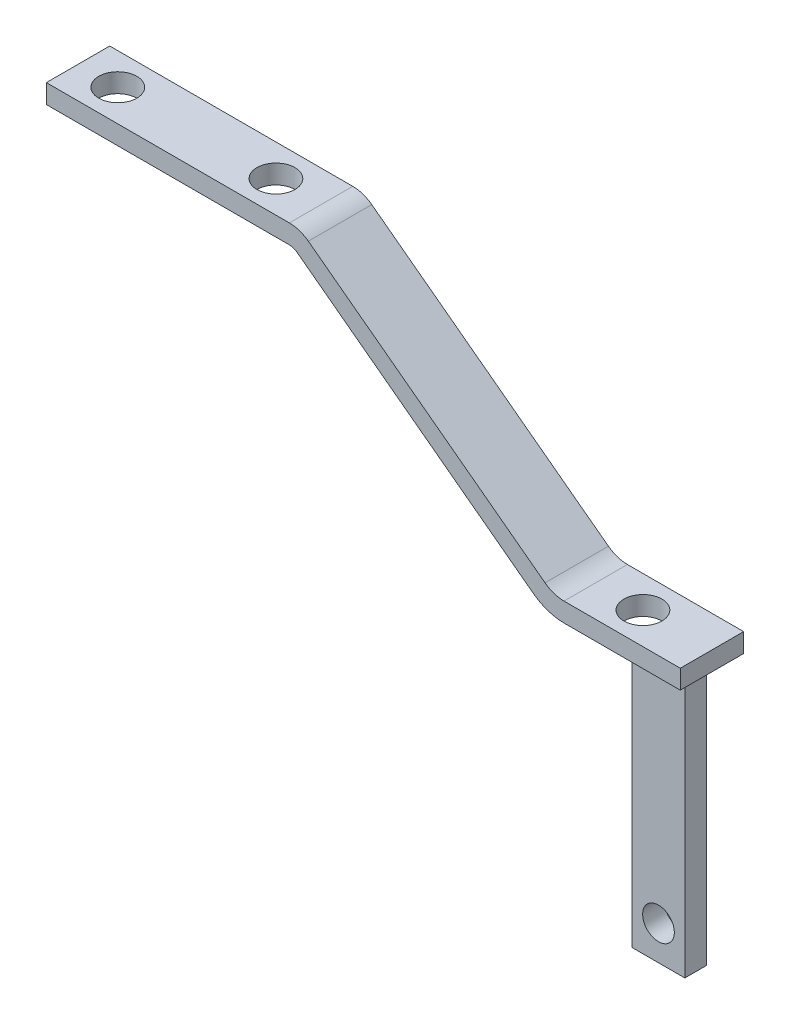
ISO-10303-21;
HEADER;
FILE_DESCRIPTION(('STEP AP214'),'2;1');
FILE_NAME('part.step','',(''),(''),'','','');
FILE_SCHEMA(('AUTOMOTIVE_DESIGN { 1 0 10303 214 1 1 1 1 }'));
ENDSEC;
DATA;
#1=APPLICATION_CONTEXT('core data for automotive mechanical design processes');
#2=APPLICATION_PROTOCOL_DEFINITION('international standard','automotive_design',2000,#1);
#3=PRODUCT_CONTEXT('',#1,'mechanical');
#4=PRODUCT('Part','Part','',(#3));
#5=PRODUCT_RELATED_PRODUCT_CATEGORY('part','',(#4));
#6=PRODUCT_DEFINITION_FORMATION('','',#4);
#7=PRODUCT_DEFINITION_CONTEXT('part definition',#1,'design');
#8=PRODUCT_DEFINITION('design','',#6,#7);
#9=PRODUCT_DEFINITION_SHAPE('','',#8);
#10=(LENGTH_UNIT() NAMED_UNIT(*) SI_UNIT(.MILLI.,.METRE.));
#11=(NAMED_UNIT(*) PLANE_ANGLE_UNIT() SI_UNIT($,.RADIAN.));
#12=(NAMED_UNIT(*) SI_UNIT($,.STERADIAN.) SOLID_ANGLE_UNIT());
#13=UNCERTAINTY_MEASURE_WITH_UNIT(LENGTH_MEASURE(1.E-05),#10,'distance_accuracy_value','');
#14=(GEOMETRIC_REPRESENTATION_CONTEXT(3) GLOBAL_UNCERTAINTY_ASSIGNED_CONTEXT((#13)) GLOBAL_UNIT_ASSIGNED_CONTEXT((#10,
#11,#12)) REPRESENTATION_CONTEXT('',''));
#15=CARTESIAN_POINT('',(0.,0.,0.));
#16=DIRECTION('',(0.,0.,1.));
#17=DIRECTION('',(1.,0.,0.));
#18=AXIS2_PLACEMENT_3D('',#15,#16,#17);
#19=CARTESIAN_POINT('',(81.6666666666667,-33.,10.));
#20=DIRECTION('',(0.,1.,0.));
#21=DIRECTION('',(0.,0.,1.));
#22=AXIS2_PLACEMENT_3D('',#19,#20,#21);
#23=PLANE('',#22);
#24=DIRECTION('',(1.,0.,0.));
#25=VECTOR('',#24,1.);
#26=CARTESIAN_POINT('',(81.6666666666667,-33.,0.));
#27=LINE('',#26,#25);
#28=CARTESIAN_POINT('',(81.6666666666667,-33.,0.));
#29=VERTEX_POINT('',#28);
#30=CARTESIAN_POINT('',(100.,-33.,0.));
#31=VERTEX_POINT('',#30);
#32=EDGE_CURVE('E269',#29,#31,#27,.T.);
#33=ORIENTED_EDGE('',*,*,#32,.T.);
#34=DIRECTION('',(0.,0.,-1.));
#35=VECTOR('',#34,1.);
#36=CARTESIAN_POINT('',(100.,-33.,10.));
#37=LINE('',#36,#35);
#38=CARTESIAN_POINT('',(100.,-33.,10.));
#39=VERTEX_POINT('',#38);
#40=EDGE_CURVE('E312',#39,#31,#37,.T.);
#41=ORIENTED_EDGE('',*,*,#40,.F.);
#42=DIRECTION('',(1.,0.,0.));
#43=VECTOR('',#42,1.);
#44=CARTESIAN_POINT('',(81.6666666666667,-33.,10.));
#45=LINE('',#44,#43);
#46=CARTESIAN_POINT('',(81.6666666666667,-33.,10.));
#47=VERTEX_POINT('',#46);
#48=EDGE_CURVE('E231',#47,#39,#45,.T.);
#49=ORIENTED_EDGE('',*,*,#48,.F.);
#50=DIRECTION('',(0.,0.,-1.));
#51=VECTOR('',#50,1.);
#52=CARTESIAN_POINT('',(81.6666666666667,-33.,10.));
#53=LINE('',#52,#51);
#54=EDGE_CURVE('E316',#47,#29,#53,.T.);
#55=ORIENTED_EDGE('',*,*,#54,.T.);
#56=EDGE_LOOP('',(#33,#41,#49,#55));
#57=FACE_BOUND('',#56,.T.);
#58=DIRECTION('',(0.,0.,-1.));
#59=VECTOR('',#58,1.);
#60=CARTESIAN_POINT('',(91.3715362952444,-33.,5.53083828494527));
#61=LINE('',#60,#59);
#62=CARTESIAN_POINT('',(91.3715362952444,-33.,8.96334899548856));
#63=VERTEX_POINT('',#62);
#64=CARTESIAN_POINT('',(91.3715362952444,-33.,6.97279566590046));
#65=VERTEX_POINT('',#64);
#66=EDGE_CURVE('E57',#63,#65,#61,.T.);
#67=ORIENTED_EDGE('',*,*,#66,.F.);
#68=DIRECTION('',(-1.,0.,0.));
#69=VECTOR('',#68,1.);
#70=CARTESIAN_POINT('',(91.3715362952444,-33.,8.96334899548856));
#71=LINE('',#70,#69);
#72=CARTESIAN_POINT('',(99.6832840549942,-33.,8.96334899548856));
#73=VERTEX_POINT('',#72);
#74=EDGE_CURVE('E61',#73,#63,#71,.T.);
#75=ORIENTED_EDGE('',*,*,#74,.F.);
#76=DIRECTION('',(0.,0.,1.));
#77=VECTOR('',#76,1.);
#78=CARTESIAN_POINT('',(99.6832840549942,-33.,5.53083828494527));
#79=LINE('',#78,#77);
#80=CARTESIAN_POINT('',(99.6832840549943,-33.,5.53083828494527));
#81=VERTEX_POINT('',#80);
#82=EDGE_CURVE('E183',#81,#73,#79,.T.);
#83=ORIENTED_EDGE('',*,*,#82,.F.);
#84=DIRECTION('',(1.,0.,0.));
#85=VECTOR('',#84,1.);
#86=CARTESIAN_POINT('',(91.3715362952444,-33.,5.53083828494527));
#87=LINE('',#86,#85);
#88=CARTESIAN_POINT('',(92.064092341446,-33.,5.53083828494527));
#89=VERTEX_POINT('',#88);
#90=EDGE_CURVE('E565',#89,#81,#87,.T.);
#91=ORIENTED_EDGE('',*,*,#90,.F.);
#92=CARTESIAN_POINT('',(89.1114307090817,-33.,5.));
#93=DIRECTION('',(0.,1.,0.));
#94=DIRECTION('',(0.,0.,1.));
#95=AXIS2_PLACEMENT_3D('',#92,#93,#94);
#96=CIRCLE('',#95,2.99999999999996);
#97=EDGE_CURVE('E185',#89,#65,#96,.T.);
#98=ORIENTED_EDGE('',*,*,#97,.T.);
#99=EDGE_LOOP('',(#67,#75,#83,#91,#98));
#100=FACE_BOUND('',#99,.T.);
#101=ADVANCED_FACE('F39',(#57,#100),#23,.F.);
#102=CARTESIAN_POINT('',(0.,0.,10.));
#103=DIRECTION('',(1.,0.,0.));
#104=DIRECTION('',(0.,0.,-1.));
#105=AXIS2_PLACEMENT_3D('',#102,#103,#104);
#106=PLANE('',#105);
#107=DIRECTION('',(0.,-1.,0.));
#108=VECTOR('',#107,1.);
#109=CARTESIAN_POINT('',(0.,0.,0.));
#110=LINE('',#109,#108);
#111=CARTESIAN_POINT('',(0.,0.,0.));
#112=VERTEX_POINT('',#111);
#113=CARTESIAN_POINT('',(0.,-3.,0.));
#114=VERTEX_POINT('',#113);
#115=EDGE_CURVE('E253',#112,#114,#110,.T.);
#116=ORIENTED_EDGE('',*,*,#115,.T.);
#117=DIRECTION('',(0.,0.,-1.));
#118=VECTOR('',#117,1.);
#119=CARTESIAN_POINT('',(0.,-3.,10.));
#120=LINE('',#119,#118);
#121=CARTESIAN_POINT('',(0.,-3.,10.));
#122=VERTEX_POINT('',#121);
#123=EDGE_CURVE('E11',#122,#114,#120,.T.);
#124=ORIENTED_EDGE('',*,*,#123,.F.);
#125=DIRECTION('',(0.,-1.,0.));
#126=VECTOR('',#125,1.);
#127=CARTESIAN_POINT('',(0.,0.,10.));
#128=LINE('',#127,#126);
#129=CARTESIAN_POINT('',(0.,0.,10.));
#130=VERTEX_POINT('',#129);
#131=EDGE_CURVE('E214',#130,#122,#128,.T.);
#132=ORIENTED_EDGE('',*,*,#131,.F.);
#133=DIRECTION('',(0.,0.,-1.));
#134=VECTOR('',#133,1.);
#135=CARTESIAN_POINT('',(0.,0.,10.));
#136=LINE('',#135,#134);
#137=EDGE_CURVE('E252',#130,#112,#136,.T.);
#138=ORIENTED_EDGE('',*,*,#137,.T.);
#139=EDGE_LOOP('',(#116,#124,#132,#138));
#140=FACE_BOUND('',#139,.T.);
#141=ADVANCED_FACE('F41',(#140),#106,.F.);
#142=CARTESIAN_POINT('',(0.,-3.,10.));
#143=DIRECTION('',(0.,1.,0.));
#144=DIRECTION('',(0.,0.,1.));
#145=AXIS2_PLACEMENT_3D('',#142,#143,#144);
#146=PLANE('',#145);
#147=CARTESIAN_POINT('',(6.26759209706049,-3.,5.));
#148=DIRECTION('',(0.,1.,0.));
#149=DIRECTION('',(0.,0.,1.));
#150=AXIS2_PLACEMENT_3D('',#147,#148,#149);
#151=CIRCLE('',#150,3.);
#152=CARTESIAN_POINT('',(6.26759209706049,-3.,8.));
#153=VERTEX_POINT('',#152);
#154=EDGE_CURVE('E209',#153,#153,#151,.T.);
#155=ORIENTED_EDGE('',*,*,#154,.T.);
#156=EDGE_LOOP('',(#155));
#157=FACE_BOUND('',#156,.T.);
#158=CARTESIAN_POINT('',(31.2160178765616,-3.,5.));
#159=DIRECTION('',(0.,1.,0.));
#160=DIRECTION('',(0.,0.,1.));
#161=AXIS2_PLACEMENT_3D('',#158,#159,#160);
#162=CIRCLE('',#161,3.);
#163=CARTESIAN_POINT('',(31.2160178765616,-3.,8.));
#164=VERTEX_POINT('',#163);
#165=EDGE_CURVE('E199',#164,#164,#162,.T.);
#166=ORIENTED_EDGE('',*,*,#165,.T.);
#167=EDGE_LOOP('',(#166));
#168=FACE_BOUND('',#167,.T.);
#169=DIRECTION('',(1.,0.,0.));
#170=VECTOR('',#169,1.);
#171=CARTESIAN_POINT('',(0.,-3.,0.));
#172=LINE('',#171,#170);
#173=CARTESIAN_POINT('',(38.3333333333333,-3.,0.));
#174=VERTEX_POINT('',#173);
#175=EDGE_CURVE('E257',#114,#174,#172,.T.);
#176=ORIENTED_EDGE('',*,*,#175,.T.);
#177=DIRECTION('',(0.,0.,-1.));
#178=VECTOR('',#177,1.);
#179=CARTESIAN_POINT('',(38.3333333333333,-3.,10.));
#180=LINE('',#179,#178);
#181=CARTESIAN_POINT('',(38.3333333333333,-3.,10.));
#182=VERTEX_POINT('',#181);
#183=EDGE_CURVE('E49',#182,#174,#180,.T.);
#184=ORIENTED_EDGE('',*,*,#183,.F.);
#185=DIRECTION('',(1.,0.,0.));
#186=VECTOR('',#185,1.);
#187=CARTESIAN_POINT('',(0.,-3.,10.));
#188=LINE('',#187,#186);
#189=EDGE_CURVE('E218',#122,#182,#188,.T.);
#190=ORIENTED_EDGE('',*,*,#189,.F.);
#191=ORIENTED_EDGE('',*,*,#123,.T.);
#192=EDGE_LOOP('',(#176,#184,#190,#191));
#193=FACE_BOUND('',#192,.T.);
#194=ADVANCED_FACE('F361',(#157,#168,#193),#146,.F.);
#195=CARTESIAN_POINT('',(38.3333333333333,-5.,10.));
#196=DIRECTION('',(0.,0.,-1.));
#197=DIRECTION('',(-1.,0.,0.));
#198=AXIS2_PLACEMENT_3D('',#195,#196,#197);
#199=CYLINDRICAL_SURFACE('',#198,2.);
#200=CARTESIAN_POINT('',(38.3333333333333,-5.,0.));
#201=DIRECTION('',(0.,0.,-1.));
#202=DIRECTION('',(-1.,0.,0.));
#203=AXIS2_PLACEMENT_3D('',#200,#201,#202);
#204=CIRCLE('',#203,2.);
#205=CARTESIAN_POINT('',(39.5333333333333,-3.4,0.));
#206=VERTEX_POINT('',#205);
#207=EDGE_CURVE('E260',#174,#206,#204,.T.);
#208=ORIENTED_EDGE('',*,*,#207,.T.);
#209=DIRECTION('',(0.,0.,-1.));
#210=VECTOR('',#209,1.);
#211=CARTESIAN_POINT('',(39.5333333333333,-3.4,10.));
#212=LINE('',#211,#210);
#213=CARTESIAN_POINT('',(39.5333333333333,-3.4,10.));
#214=VERTEX_POINT('',#213);
#215=EDGE_CURVE('E324',#214,#206,#212,.T.);
#216=ORIENTED_EDGE('',*,*,#215,.F.);
#217=CARTESIAN_POINT('',(38.3333333333333,-5.,10.));
#218=DIRECTION('',(0.,0.,-1.));
#219=DIRECTION('',(-1.,0.,0.));
#220=AXIS2_PLACEMENT_3D('',#217,#218,#219);
#221=CIRCLE('',#220,2.);
#222=EDGE_CURVE('E222',#182,#214,#221,.T.);
#223=ORIENTED_EDGE('',*,*,#222,.F.);
#224=ORIENTED_EDGE('',*,*,#183,.T.);
#225=EDGE_LOOP('',(#208,#216,#223,#224));
#226=FACE_BOUND('',#225,.T.);
#227=ADVANCED_FACE('F374',(#226),#199,.F.);
#228=CARTESIAN_POINT('',(39.5333333333333,-3.4,10.));
#229=DIRECTION('',(0.6,0.8,0.));
#230=DIRECTION('',(-0.8,0.6,0.));
#231=AXIS2_PLACEMENT_3D('',#228,#229,#230);
#232=PLANE('',#231);
#233=DIRECTION('',(0.8,-0.6,0.));
#234=VECTOR('',#233,1.);
#235=CARTESIAN_POINT('',(39.5333333333333,-3.4,0.));
#236=LINE('',#235,#234);
#237=CARTESIAN_POINT('',(76.8666666666667,-31.4,0.));
#238=VERTEX_POINT('',#237);
#239=EDGE_CURVE('E263',#206,#238,#236,.T.);
#240=ORIENTED_EDGE('',*,*,#239,.T.);
#241=DIRECTION('',(0.,0.,-1.));
#242=VECTOR('',#241,1.);
#243=CARTESIAN_POINT('',(76.8666666666667,-31.4,10.));
#244=LINE('',#243,#242);
#245=CARTESIAN_POINT('',(76.8666666666667,-31.4,10.));
#246=VERTEX_POINT('',#245);
#247=EDGE_CURVE('E320',#246,#238,#244,.T.);
#248=ORIENTED_EDGE('',*,*,#247,.F.);
#249=DIRECTION('',(0.8,-0.6,0.));
#250=VECTOR('',#249,1.);
#251=CARTESIAN_POINT('',(39.5333333333333,-3.4,10.));
#252=LINE('',#251,#250);
#253=EDGE_CURVE('E225',#214,#246,#252,.T.);
#254=ORIENTED_EDGE('',*,*,#253,.F.);
#255=ORIENTED_EDGE('',*,*,#215,.T.);
#256=EDGE_LOOP('',(#240,#248,#254,#255));
#257=FACE_BOUND('',#256,.T.);
#258=ADVANCED_FACE('F370',(#257),#232,.F.);
#259=CARTESIAN_POINT('',(81.6666666666667,-25.,10.));
#260=DIRECTION('',(0.,0.,-1.));
#261=DIRECTION('',(-1.,0.,0.));
#262=AXIS2_PLACEMENT_3D('',#259,#260,#261);
#263=CYLINDRICAL_SURFACE('',#262,8.);
#264=CARTESIAN_POINT('',(81.6666666666667,-25.,0.));
#265=DIRECTION('',(0.,0.,1.));
#266=DIRECTION('',(1.,0.,0.));
#267=AXIS2_PLACEMENT_3D('',#264,#265,#266);
#268=CIRCLE('',#267,8.);
#269=EDGE_CURVE('E266',#238,#29,#268,.T.);
#270=ORIENTED_EDGE('',*,*,#269,.T.);
#271=ORIENTED_EDGE('',*,*,#54,.F.);
#272=CARTESIAN_POINT('',(81.6666666666667,-25.,10.));
#273=DIRECTION('',(0.,0.,1.));
#274=DIRECTION('',(1.,0.,0.));
#275=AXIS2_PLACEMENT_3D('',#272,#273,#274);
#276=CIRCLE('',#275,8.);
#277=EDGE_CURVE('E228',#246,#47,#276,.T.);
#278=ORIENTED_EDGE('',*,*,#277,.F.);
#279=ORIENTED_EDGE('',*,*,#247,.T.);
#280=EDGE_LOOP('',(#270,#271,#278,#279));
#281=FACE_BOUND('',#280,.T.);
#282=ADVANCED_FACE('F367',(#281),#263,.T.);
#283=CARTESIAN_POINT('',(100.,-30.,10.));
#284=DIRECTION('',(-1.,0.,0.));
#285=DIRECTION('',(0.,0.,1.));
#286=AXIS2_PLACEMENT_3D('',#283,#284,#285);
#287=PLANE('',#286);
#288=DIRECTION('',(0.,1.,0.));
#289=VECTOR('',#288,1.);
#290=CARTESIAN_POINT('',(100.,-30.,0.));
#291=LINE('',#290,#289);
#292=CARTESIAN_POINT('',(100.,-30.,0.));
#293=VERTEX_POINT('',#292);
#294=EDGE_CURVE('E272',#31,#293,#291,.T.);
#295=ORIENTED_EDGE('',*,*,#294,.T.);
#296=DIRECTION('',(0.,0.,-1.));
#297=VECTOR('',#296,1.);
#298=CARTESIAN_POINT('',(100.,-30.,10.));
#299=LINE('',#298,#297);
#300=CARTESIAN_POINT('',(100.,-30.,10.));
#301=VERTEX_POINT('',#300);
#302=EDGE_CURVE('E308',#301,#293,#299,.T.);
#303=ORIENTED_EDGE('',*,*,#302,.F.);
#304=DIRECTION('',(0.,1.,0.));
#305=VECTOR('',#304,1.);
#306=CARTESIAN_POINT('',(100.,-30.,10.));
#307=LINE('',#306,#305);
#308=EDGE_CURVE('E234',#39,#301,#307,.T.);
#309=ORIENTED_EDGE('',*,*,#308,.F.);
#310=ORIENTED_EDGE('',*,*,#40,.T.);
#311=EDGE_LOOP('',(#295,#303,#309,#310));
#312=FACE_BOUND('',#311,.T.);
#313=ADVANCED_FACE('F365',(#312),#287,.F.);
#314=CARTESIAN_POINT('',(81.6666666666667,-30.,10.));
#315=DIRECTION('',(0.,-1.,0.));
#316=DIRECTION('',(0.,0.,-1.));
#317=AXIS2_PLACEMENT_3D('',#314,#315,#316);
#318=PLANE('',#317);
#319=CARTESIAN_POINT('',(89.1114307090817,-30.,5.));
#320=DIRECTION('',(0.,-1.,0.));
#321=DIRECTION('',(0.,0.,-1.));
#322=AXIS2_PLACEMENT_3D('',#319,#320,#321);
#323=CIRCLE('',#322,2.99999999999996);
#324=CARTESIAN_POINT('',(89.1114307090817,-30.,2.00000000000004));
#325=VERTEX_POINT('',#324);
#326=EDGE_CURVE('E213',#325,#325,#323,.T.);
#327=ORIENTED_EDGE('',*,*,#326,.T.);
#328=EDGE_LOOP('',(#327));
#329=FACE_BOUND('',#328,.T.);
#330=DIRECTION('',(-1.,0.,0.));
#331=VECTOR('',#330,1.);
#332=CARTESIAN_POINT('',(81.6666666666667,-30.,0.));
#333=LINE('',#332,#331);
#334=CARTESIAN_POINT('',(81.6666666666667,-30.,0.));
#335=VERTEX_POINT('',#334);
#336=EDGE_CURVE('E275',#293,#335,#333,.T.);
#337=ORIENTED_EDGE('',*,*,#336,.T.);
#338=DIRECTION('',(0.,0.,-1.));
#339=VECTOR('',#338,1.);
#340=CARTESIAN_POINT('',(81.6666666666667,-30.,10.));
#341=LINE('',#340,#339);
#342=CARTESIAN_POINT('',(81.6666666666667,-30.,10.));
#343=VERTEX_POINT('',#342);
#344=EDGE_CURVE('E304',#343,#335,#341,.T.);
#345=ORIENTED_EDGE('',*,*,#344,.F.);
#346=DIRECTION('',(-1.,0.,0.));
#347=VECTOR('',#346,1.);
#348=CARTESIAN_POINT('',(81.6666666666667,-30.,10.));
#349=LINE('',#348,#347);
#350=EDGE_CURVE('E237',#301,#343,#349,.T.);
#351=ORIENTED_EDGE('',*,*,#350,.F.);
#352=ORIENTED_EDGE('',*,*,#302,.T.);
#353=EDGE_LOOP('',(#337,#345,#351,#352));
#354=FACE_BOUND('',#353,.T.);
#355=ADVANCED_FACE('F334',(#329,#354),#318,.F.);
#356=CARTESIAN_POINT('',(81.6666666666667,-25.,10.));
#357=DIRECTION('',(0.,0.,-1.));
#358=DIRECTION('',(-1.,0.,0.));
#359=AXIS2_PLACEMENT_3D('',#356,#357,#358);
#360=CYLINDRICAL_SURFACE('',#359,5.);
#361=CARTESIAN_POINT('',(81.6666666666667,-25.,0.));
#362=DIRECTION('',(0.,0.,-1.));
#363=DIRECTION('',(1.,0.,0.));
#364=AXIS2_PLACEMENT_3D('',#361,#362,#363);
#365=CIRCLE('',#364,5.);
#366=CARTESIAN_POINT('',(78.6666666666667,-29.,0.));
#367=VERTEX_POINT('',#366);
#368=EDGE_CURVE('E278',#335,#367,#365,.T.);
#369=ORIENTED_EDGE('',*,*,#368,.T.);
#370=DIRECTION('',(0.,0.,-1.));
#371=VECTOR('',#370,1.);
#372=CARTESIAN_POINT('',(78.6666666666667,-29.,10.));
#373=LINE('',#372,#371);
#374=CARTESIAN_POINT('',(78.6666666666667,-29.,10.));
#375=VERTEX_POINT('',#374);
#376=EDGE_CURVE('E300',#375,#367,#373,.T.);
#377=ORIENTED_EDGE('',*,*,#376,.F.);
#378=CARTESIAN_POINT('',(81.6666666666667,-25.,10.));
#379=DIRECTION('',(0.,0.,-1.));
#380=DIRECTION('',(1.,0.,0.));
#381=AXIS2_PLACEMENT_3D('',#378,#379,#380);
#382=CIRCLE('',#381,5.);
#383=EDGE_CURVE('E240',#343,#375,#382,.T.);
#384=ORIENTED_EDGE('',*,*,#383,.F.);
#385=ORIENTED_EDGE('',*,*,#344,.T.);
#386=EDGE_LOOP('',(#369,#377,#384,#385));
#387=FACE_BOUND('',#386,.T.);
#388=ADVANCED_FACE('F426',(#387),#360,.F.);
#389=CARTESIAN_POINT('',(41.3333333333333,-1.,10.));
#390=DIRECTION('',(-0.6,-0.8,0.));
#391=DIRECTION('',(0.8,-0.6,0.));
#392=AXIS2_PLACEMENT_3D('',#389,#390,#391);
#393=PLANE('',#392);
#394=DIRECTION('',(-0.8,0.6,0.));
#395=VECTOR('',#394,1.);
#396=CARTESIAN_POINT('',(41.3333333333333,-1.,0.));
#397=LINE('',#396,#395);
#398=CARTESIAN_POINT('',(41.3333333333333,-1.,0.));
#399=VERTEX_POINT('',#398);
#400=EDGE_CURVE('E281',#367,#399,#397,.T.);
#401=ORIENTED_EDGE('',*,*,#400,.T.);
#402=DIRECTION('',(0.,0.,-1.));
#403=VECTOR('',#402,1.);
#404=CARTESIAN_POINT('',(41.3333333333333,-1.,10.));
#405=LINE('',#404,#403);
#406=CARTESIAN_POINT('',(41.3333333333333,-1.,10.));
#407=VERTEX_POINT('',#406);
#408=EDGE_CURVE('E296',#407,#399,#405,.T.);
#409=ORIENTED_EDGE('',*,*,#408,.F.);
#410=DIRECTION('',(-0.8,0.6,0.));
#411=VECTOR('',#410,1.);
#412=CARTESIAN_POINT('',(41.3333333333333,-1.,10.));
#413=LINE('',#412,#411);
#414=EDGE_CURVE('E243',#375,#407,#413,.T.);
#415=ORIENTED_EDGE('',*,*,#414,.F.);
#416=ORIENTED_EDGE('',*,*,#376,.T.);
#417=EDGE_LOOP('',(#401,#409,#415,#416));
#418=FACE_BOUND('',#417,.T.);
#419=ADVANCED_FACE('F420',(#418),#393,.F.);
#420=CARTESIAN_POINT('',(38.3333333333333,-5.,10.));
#421=DIRECTION('',(0.,0.,-1.));
#422=DIRECTION('',(-1.,0.,0.));
#423=AXIS2_PLACEMENT_3D('',#420,#421,#422);
#424=CYLINDRICAL_SURFACE('',#423,5.);
#425=CARTESIAN_POINT('',(38.3333333333333,-5.,0.));
#426=DIRECTION('',(0.,0.,1.));
#427=DIRECTION('',(-1.,0.,0.));
#428=AXIS2_PLACEMENT_3D('',#425,#426,#427);
#429=CIRCLE('',#428,5.);
#430=CARTESIAN_POINT('',(38.3333333333333,0.,0.));
#431=VERTEX_POINT('',#430);
#432=EDGE_CURVE('E284',#399,#431,#429,.T.);
#433=ORIENTED_EDGE('',*,*,#432,.T.);
#434=DIRECTION('',(0.,0.,-1.));
#435=VECTOR('',#434,1.);
#436=CARTESIAN_POINT('',(38.3333333333333,0.,10.));
#437=LINE('',#436,#435);
#438=CARTESIAN_POINT('',(38.3333333333333,0.,10.));
#439=VERTEX_POINT('',#438);
#440=EDGE_CURVE('E292',#439,#431,#437,.T.);
#441=ORIENTED_EDGE('',*,*,#440,.F.);
#442=CARTESIAN_POINT('',(38.3333333333333,-5.,10.));
#443=DIRECTION('',(0.,0.,1.));
#444=DIRECTION('',(-1.,0.,0.));
#445=AXIS2_PLACEMENT_3D('',#442,#443,#444);
#446=CIRCLE('',#445,5.);
#447=EDGE_CURVE('E246',#407,#439,#446,.T.);
#448=ORIENTED_EDGE('',*,*,#447,.F.);
#449=ORIENTED_EDGE('',*,*,#408,.T.);
#450=EDGE_LOOP('',(#433,#441,#448,#449));
#451=FACE_BOUND('',#450,.T.);
#452=ADVANCED_FACE('F416',(#451),#424,.T.);
#453=CARTESIAN_POINT('',(0.,0.,10.));
#454=DIRECTION('',(0.,-1.,0.));
#455=DIRECTION('',(0.,0.,-1.));
#456=AXIS2_PLACEMENT_3D('',#453,#454,#455);
#457=PLANE('',#456);
#458=CARTESIAN_POINT('',(6.26759209706049,0.,5.));
#459=DIRECTION('',(0.,1.,0.));
#460=DIRECTION('',(0.,0.,1.));
#461=AXIS2_PLACEMENT_3D('',#458,#459,#460);
#462=CIRCLE('',#461,3.);
#463=CARTESIAN_POINT('',(6.26759209706049,0.,8.));
#464=VERTEX_POINT('',#463);
#465=EDGE_CURVE('E195',#464,#464,#462,.T.);
#466=ORIENTED_EDGE('',*,*,#465,.F.);
#467=EDGE_LOOP('',(#466));
#468=FACE_BOUND('',#467,.T.);
#469=CARTESIAN_POINT('',(31.2160178765616,0.,5.));
#470=DIRECTION('',(0.,1.,0.));
#471=DIRECTION('',(0.,0.,1.));
#472=AXIS2_PLACEMENT_3D('',#469,#470,#471);
#473=CIRCLE('',#472,3.);
#474=CARTESIAN_POINT('',(31.2160178765616,0.,8.));
#475=VERTEX_POINT('',#474);
#476=EDGE_CURVE('E200',#475,#475,#473,.T.);
#477=ORIENTED_EDGE('',*,*,#476,.F.);
#478=EDGE_LOOP('',(#477));
#479=FACE_BOUND('',#478,.T.);
#480=DIRECTION('',(-1.,0.,0.));
#481=VECTOR('',#480,1.);
#482=CARTESIAN_POINT('',(0.,0.,0.));
#483=LINE('',#482,#481);
#484=EDGE_CURVE('E219',#431,#112,#483,.T.);
#485=ORIENTED_EDGE('',*,*,#484,.T.);
#486=ORIENTED_EDGE('',*,*,#137,.F.);
#487=DIRECTION('',(-1.,0.,0.));
#488=VECTOR('',#487,1.);
#489=CARTESIAN_POINT('',(0.,0.,10.));
#490=LINE('',#489,#488);
#491=EDGE_CURVE('E249',#439,#130,#490,.T.);
#492=ORIENTED_EDGE('',*,*,#491,.F.);
#493=ORIENTED_EDGE('',*,*,#440,.T.);
#494=EDGE_LOOP('',(#485,#486,#492,#493));
#495=FACE_BOUND('',#494,.T.);
#496=ADVANCED_FACE('F412',(#468,#479,#495),#457,.F.);
#497=CARTESIAN_POINT('',(38.3333333333333,-5.,10.));
#498=DIRECTION('',(0.,0.,-1.));
#499=DIRECTION('',(-1.,0.,0.));
#500=AXIS2_PLACEMENT_3D('',#497,#498,#499);
#501=PLANE('',#500);
#502=ORIENTED_EDGE('',*,*,#131,.T.);
#503=ORIENTED_EDGE('',*,*,#189,.T.);
#504=ORIENTED_EDGE('',*,*,#222,.T.);
#505=ORIENTED_EDGE('',*,*,#253,.T.);
#506=ORIENTED_EDGE('',*,*,#277,.T.);
#507=ORIENTED_EDGE('',*,*,#48,.T.);
#508=ORIENTED_EDGE('',*,*,#308,.T.);
#509=ORIENTED_EDGE('',*,*,#350,.T.);
#510=ORIENTED_EDGE('',*,*,#383,.T.);
#511=ORIENTED_EDGE('',*,*,#414,.T.);
#512=ORIENTED_EDGE('',*,*,#447,.T.);
#513=ORIENTED_EDGE('',*,*,#491,.T.);
#514=EDGE_LOOP('',(#502,#503,#504,#505,#506,#507,#508,#509,#510,#511,#512,#513));
#515=FACE_BOUND('',#514,.T.);
#516=ADVANCED_FACE('F403',(#515),#501,.F.);
#517=CARTESIAN_POINT('',(38.3333333333333,-5.,0.));
#518=DIRECTION('',(0.,0.,-1.));
#519=DIRECTION('',(-1.,0.,0.));
#520=AXIS2_PLACEMENT_3D('',#517,#518,#519);
#521=PLANE('',#520);
#522=ORIENTED_EDGE('',*,*,#115,.F.);
#523=ORIENTED_EDGE('',*,*,#484,.F.);
#524=ORIENTED_EDGE('',*,*,#432,.F.);
#525=ORIENTED_EDGE('',*,*,#400,.F.);
#526=ORIENTED_EDGE('',*,*,#368,.F.);
#527=ORIENTED_EDGE('',*,*,#336,.F.);
#528=ORIENTED_EDGE('',*,*,#294,.F.);
#529=ORIENTED_EDGE('',*,*,#32,.F.);
#530=ORIENTED_EDGE('',*,*,#269,.F.);
#531=ORIENTED_EDGE('',*,*,#239,.F.);
#532=ORIENTED_EDGE('',*,*,#207,.F.);
#533=ORIENTED_EDGE('',*,*,#175,.F.);
#534=EDGE_LOOP('',(#522,#523,#524,#525,#526,#527,#528,#529,#530,#531,#532,#533));
#535=FACE_BOUND('',#534,.T.);
#536=ADVANCED_FACE('F394',(#535),#521,.T.);
#537=CARTESIAN_POINT('',(31.2160178765616,-33.,5.));
#538=DIRECTION('',(0.,1.,0.));
#539=DIRECTION('',(0.,0.,1.));
#540=AXIS2_PLACEMENT_3D('',#537,#538,#539);
#541=CYLINDRICAL_SURFACE('',#540,3.);
#542=ORIENTED_EDGE('',*,*,#476,.T.);
#543=EDGE_LOOP('',(#542));
#544=FACE_BOUND('',#543,.T.);
#545=ORIENTED_EDGE('',*,*,#165,.F.);
#546=EDGE_LOOP('',(#545));
#547=FACE_BOUND('',#546,.T.);
#548=ADVANCED_FACE('F349',(#544,#547),#541,.F.);
#549=CARTESIAN_POINT('',(6.26759209706049,-33.,5.));
#550=DIRECTION('',(0.,1.,0.));
#551=DIRECTION('',(0.,0.,1.));
#552=AXIS2_PLACEMENT_3D('',#549,#550,#551);
#553=CYLINDRICAL_SURFACE('',#552,3.);
#554=ORIENTED_EDGE('',*,*,#465,.T.);
#555=EDGE_LOOP('',(#554));
#556=FACE_BOUND('',#555,.T.);
#557=ORIENTED_EDGE('',*,*,#154,.F.);
#558=EDGE_LOOP('',(#557));
#559=FACE_BOUND('',#558,.T.);
#560=ADVANCED_FACE('F340',(#556,#559),#553,.F.);
#561=CARTESIAN_POINT('',(89.1114307090817,-33.,5.));
#562=DIRECTION('',(0.,1.,0.));
#563=DIRECTION('',(0.,0.,1.));
#564=AXIS2_PLACEMENT_3D('',#561,#562,#563);
#565=CYLINDRICAL_SURFACE('',#564,2.99999999999996);
#566=EDGE_CURVE('E189',#65,#89,#96,.T.);
#567=ORIENTED_EDGE('',*,*,#566,.F.);
#568=ORIENTED_EDGE('',*,*,#97,.F.);
#569=EDGE_LOOP('',(#567,#568));
#570=FACE_BOUND('',#569,.T.);
#571=ORIENTED_EDGE('',*,*,#326,.F.);
#572=EDGE_LOOP('',(#571));
#573=FACE_BOUND('',#572,.T.);
#574=ADVANCED_FACE('F337',(#570,#573),#565,.F.);
#575=CARTESIAN_POINT('',(0.,-33.,0.));
#576=DIRECTION('',(0.,1.,0.));
#577=DIRECTION('',(-1.,0.,0.));
#578=AXIS2_PLACEMENT_3D('',#575,#576,#577);
#579=PLANE('',#578);
#580=ORIENTED_EDGE('',*,*,#566,.T.);
#581=CARTESIAN_POINT('',(91.3715362952444,-33.,5.53083828494527));
#582=VERTEX_POINT('',#581);
#583=EDGE_CURVE('E180',#582,#89,#87,.T.);
#584=ORIENTED_EDGE('',*,*,#583,.F.);
#585=EDGE_CURVE('E562',#65,#582,#61,.T.);
#586=ORIENTED_EDGE('',*,*,#585,.F.);
#587=EDGE_LOOP('',(#580,#584,#586));
#588=FACE_BOUND('',#587,.T.);
#589=ADVANCED_FACE('F339',(#588),#579,.T.);
#590=CARTESIAN_POINT('',(99.6832840549943,-73.,5.53083828494527));
#591=DIRECTION('',(-1.,0.,0.));
#592=DIRECTION('',(0.,-1.,0.));
#593=AXIS2_PLACEMENT_3D('',#590,#591,#592);
#594=PLANE('',#593);
#595=ORIENTED_EDGE('',*,*,#82,.T.);
#596=DIRECTION('',(0.,1.,0.));
#597=VECTOR('',#596,1.);
#598=CARTESIAN_POINT('',(99.6832840549943,-73.,8.96334899548856));
#599=LINE('',#598,#597);
#600=CARTESIAN_POINT('',(99.6832840549943,-73.,8.96334899548856));
#601=VERTEX_POINT('',#600);
#602=EDGE_CURVE('E162',#601,#73,#599,.T.);
#603=ORIENTED_EDGE('',*,*,#602,.F.);
#604=DIRECTION('',(0.,0.,1.));
#605=VECTOR('',#604,1.);
#606=CARTESIAN_POINT('',(99.6832840549943,-73.,5.53083828494527));
#607=LINE('',#606,#605);
#608=CARTESIAN_POINT('',(99.6832840549943,-73.,5.53083828494527));
#609=VERTEX_POINT('',#608);
#610=EDGE_CURVE('E170',#609,#601,#607,.T.);
#611=ORIENTED_EDGE('',*,*,#610,.F.);
#612=DIRECTION('',(0.,1.,0.));
#613=VECTOR('',#612,1.);
#614=CARTESIAN_POINT('',(99.6832840549943,-73.,5.53083828494527));
#615=LINE('',#614,#613);
#616=EDGE_CURVE('E558',#609,#81,#615,.T.);
#617=ORIENTED_EDGE('',*,*,#616,.T.);
#618=EDGE_LOOP('',(#595,#603,#611,#617));
#619=FACE_BOUND('',#618,.T.);
#620=ADVANCED_FACE('F182',(#619),#594,.F.);
#621=CARTESIAN_POINT('',(91.3715362952445,-73.,8.96334899548856));
#622=DIRECTION('',(0.,0.,-1.));
#623=DIRECTION('',(-1.,0.,0.));
#624=AXIS2_PLACEMENT_3D('',#621,#622,#623);
#625=PLANE('',#624);
#626=CARTESIAN_POINT('',(95.5274101751194,-67.614542538152,8.96334899548856));
#627=DIRECTION('',(0.,0.,1.));
#628=DIRECTION('',(1.,0.,0.));
#629=AXIS2_PLACEMENT_3D('',#626,#627,#628);
#630=CIRCLE('',#629,2.50000000000001);
#631=CARTESIAN_POINT('',(98.0274101751194,-67.614542538152,8.96334899548856));
#632=VERTEX_POINT('',#631);
#633=EDGE_CURVE('E546',#632,#632,#630,.T.);
#634=ORIENTED_EDGE('',*,*,#633,.F.);
#635=EDGE_LOOP('',(#634));
#636=FACE_BOUND('',#635,.T.);
#637=ORIENTED_EDGE('',*,*,#74,.T.);
#638=DIRECTION('',(0.,1.,0.));
#639=VECTOR('',#638,1.);
#640=CARTESIAN_POINT('',(91.3715362952445,-73.,8.96334899548856));
#641=LINE('',#640,#639);
#642=CARTESIAN_POINT('',(91.3715362952445,-73.,8.96334899548856));
#643=VERTEX_POINT('',#642);
#644=EDGE_CURVE('E165',#643,#63,#641,.T.);
#645=ORIENTED_EDGE('',*,*,#644,.F.);
#646=DIRECTION('',(-1.,0.,0.));
#647=VECTOR('',#646,1.);
#648=CARTESIAN_POINT('',(91.3715362952445,-73.,8.96334899548856));
#649=LINE('',#648,#647);
#650=EDGE_CURVE('E158',#601,#643,#649,.T.);
#651=ORIENTED_EDGE('',*,*,#650,.F.);
#652=ORIENTED_EDGE('',*,*,#602,.T.);
#653=EDGE_LOOP('',(#637,#645,#651,#652));
#654=FACE_BOUND('',#653,.T.);
#655=ADVANCED_FACE('F160',(#636,#654),#625,.F.);
#656=CARTESIAN_POINT('',(91.3715362952445,-73.,5.53083828494527));
#657=DIRECTION('',(1.,0.,0.));
#658=DIRECTION('',(0.,1.,0.));
#659=AXIS2_PLACEMENT_3D('',#656,#657,#658);
#660=PLANE('',#659);
#661=ORIENTED_EDGE('',*,*,#66,.T.);
#662=ORIENTED_EDGE('',*,*,#585,.T.);
#663=DIRECTION('',(0.,1.,0.));
#664=VECTOR('',#663,1.);
#665=CARTESIAN_POINT('',(91.3715362952445,-73.,5.53083828494527));
#666=LINE('',#665,#664);
#667=CARTESIAN_POINT('',(91.3715362952445,-73.,5.53083828494527));
#668=VERTEX_POINT('',#667);
#669=EDGE_CURVE('E191',#668,#582,#666,.T.);
#670=ORIENTED_EDGE('',*,*,#669,.F.);
#671=DIRECTION('',(0.,0.,-1.));
#672=VECTOR('',#671,1.);
#673=CARTESIAN_POINT('',(91.3715362952445,-73.,5.53083828494527));
#674=LINE('',#673,#672);
#675=EDGE_CURVE('E169',#643,#668,#674,.T.);
#676=ORIENTED_EDGE('',*,*,#675,.F.);
#677=ORIENTED_EDGE('',*,*,#644,.T.);
#678=EDGE_LOOP('',(#661,#662,#670,#676,#677));
#679=FACE_BOUND('',#678,.T.);
#680=ADVANCED_FACE('F499',(#679),#660,.F.);
#681=CARTESIAN_POINT('',(91.3715362952445,-73.,5.53083828494527));
#682=DIRECTION('',(0.,0.,1.));
#683=DIRECTION('',(1.,0.,0.));
#684=AXIS2_PLACEMENT_3D('',#681,#682,#683);
#685=PLANE('',#684);
#686=CARTESIAN_POINT('',(95.5274101751194,-67.614542538152,5.53083828494527));
#687=DIRECTION('',(0.,0.,1.));
#688=DIRECTION('',(1.,0.,0.));
#689=AXIS2_PLACEMENT_3D('',#686,#687,#688);
#690=CIRCLE('',#689,2.50000000000001);
#691=CARTESIAN_POINT('',(98.0274101751194,-67.614542538152,5.53083828494527));
#692=VERTEX_POINT('',#691);
#693=EDGE_CURVE('E43',#692,#692,#690,.T.);
#694=ORIENTED_EDGE('',*,*,#693,.T.);
#695=EDGE_LOOP('',(#694));
#696=FACE_BOUND('',#695,.T.);
#697=ORIENTED_EDGE('',*,*,#583,.T.);
#698=ORIENTED_EDGE('',*,*,#90,.T.);
#699=ORIENTED_EDGE('',*,*,#616,.F.);
#700=DIRECTION('',(1.,0.,0.));
#701=VECTOR('',#700,1.);
#702=CARTESIAN_POINT('',(91.3715362952445,-73.,5.53083828494527));
#703=LINE('',#702,#701);
#704=EDGE_CURVE('E175',#668,#609,#703,.T.);
#705=ORIENTED_EDGE('',*,*,#704,.F.);
#706=ORIENTED_EDGE('',*,*,#669,.T.);
#707=EDGE_LOOP('',(#697,#698,#699,#705,#706));
#708=FACE_BOUND('',#707,.T.);
#709=ADVANCED_FACE('F504',(#696,#708),#685,.F.);
#710=CARTESIAN_POINT('',(0.,-73.0000000000001,0.));
#711=DIRECTION('',(0.,1.,0.));
#712=DIRECTION('',(-1.,0.,0.));
#713=AXIS2_PLACEMENT_3D('',#710,#711,#712);
#714=PLANE('',#713);
#715=ORIENTED_EDGE('',*,*,#610,.T.);
#716=ORIENTED_EDGE('',*,*,#650,.T.);
#717=ORIENTED_EDGE('',*,*,#675,.T.);
#718=ORIENTED_EDGE('',*,*,#704,.T.);
#719=EDGE_LOOP('',(#715,#716,#717,#718));
#720=FACE_BOUND('',#719,.T.);
#721=ADVANCED_FACE('F173',(#720),#714,.F.);
#722=CARTESIAN_POINT('',(95.5274101751194,-67.614542538152,0.));
#723=DIRECTION('',(0.,0.,1.));
#724=DIRECTION('',(1.,0.,0.));
#725=AXIS2_PLACEMENT_3D('',#722,#723,#724);
#726=CYLINDRICAL_SURFACE('',#725,2.50000000000001);
#727=ORIENTED_EDGE('',*,*,#633,.T.);
#728=EDGE_LOOP('',(#727));
#729=FACE_BOUND('',#728,.T.);
#730=ORIENTED_EDGE('',*,*,#693,.F.);
#731=EDGE_LOOP('',(#730));
#732=FACE_BOUND('',#731,.T.);
#733=ADVANCED_FACE('F516',(#729,#732),#726,.F.);
#734=CLOSED_SHELL('',(#101,#141,#194,#227,#258,#282,#313,#355,#388,#419,#452,#496,#516,#536,
#548,#560,#574,#589,#620,#655,#680,#709,#721,#733));
#735=MANIFOLD_SOLID_BREP('B2',#734);
#736=ADVANCED_BREP_SHAPE_REPRESENTATION('',(#18,#735),#14);
#737=SHAPE_DEFINITION_REPRESENTATION(#9,#736);
ENDSEC;
END-ISO-10303-21;
